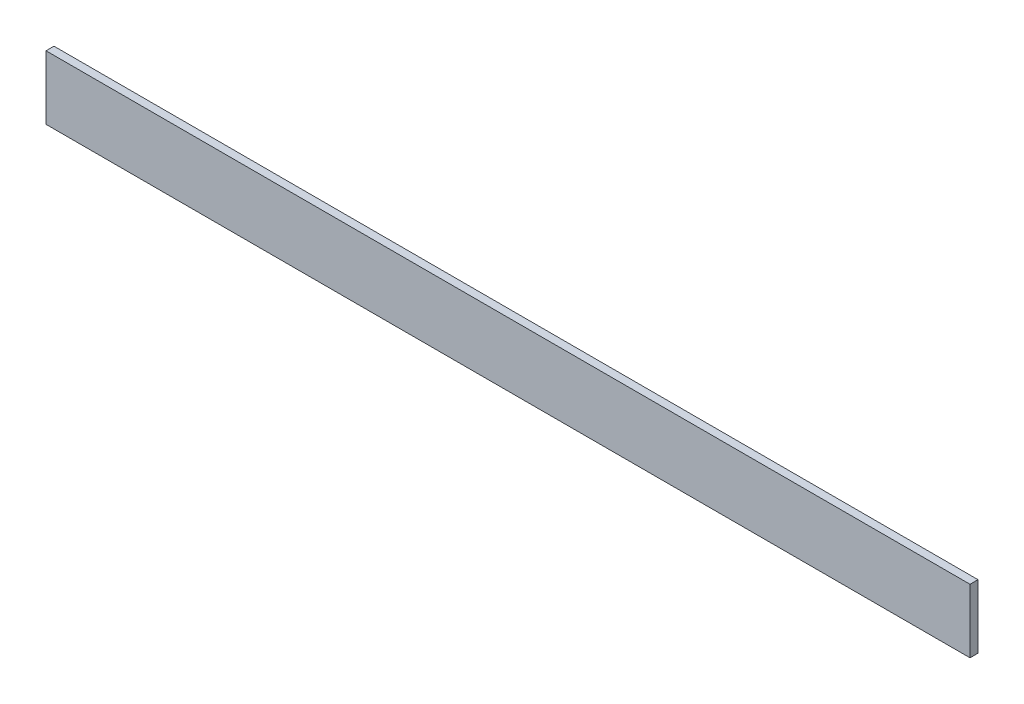
ISO-10303-21;
HEADER;
FILE_DESCRIPTION(('STEP AP214'),'2;1');
FILE_NAME('part.step','',(''),(''),'','','');
FILE_SCHEMA(('AUTOMOTIVE_DESIGN { 1 0 10303 214 1 1 1 1 }'));
ENDSEC;
DATA;
#1=APPLICATION_CONTEXT('core data for automotive mechanical design processes');
#2=APPLICATION_PROTOCOL_DEFINITION('international standard','automotive_design',2000,#1);
#3=PRODUCT_CONTEXT('',#1,'mechanical');
#4=PRODUCT('Part','Part','',(#3));
#5=PRODUCT_RELATED_PRODUCT_CATEGORY('part','',(#4));
#6=PRODUCT_DEFINITION_FORMATION('','',#4);
#7=PRODUCT_DEFINITION_CONTEXT('part definition',#1,'design');
#8=PRODUCT_DEFINITION('design','',#6,#7);
#9=PRODUCT_DEFINITION_SHAPE('','',#8);
#10=(LENGTH_UNIT() NAMED_UNIT(*) SI_UNIT(.MILLI.,.METRE.));
#11=(NAMED_UNIT(*) PLANE_ANGLE_UNIT() SI_UNIT($,.RADIAN.));
#12=(NAMED_UNIT(*) SI_UNIT($,.STERADIAN.) SOLID_ANGLE_UNIT());
#13=UNCERTAINTY_MEASURE_WITH_UNIT(LENGTH_MEASURE(1.E-05),#10,'distance_accuracy_value','');
#14=(GEOMETRIC_REPRESENTATION_CONTEXT(3) GLOBAL_UNCERTAINTY_ASSIGNED_CONTEXT((#13)) GLOBAL_UNIT_ASSIGNED_CONTEXT((#10,
#11,#12)) REPRESENTATION_CONTEXT('',''));
#15=CARTESIAN_POINT('',(0.,0.,0.));
#16=DIRECTION('',(0.,0.,1.));
#17=DIRECTION('',(1.,0.,0.));
#18=AXIS2_PLACEMENT_3D('',#15,#16,#17);
#19=CARTESIAN_POINT('',(290.,-20.,5.));
#20=DIRECTION('',(-1.,0.,0.));
#21=DIRECTION('',(0.,0.,1.));
#22=AXIS2_PLACEMENT_3D('',#19,#20,#21);
#23=PLANE('',#22);
#24=DIRECTION('',(0.,1.,0.));
#25=VECTOR('',#24,1.);
#26=CARTESIAN_POINT('',(290.,-20.,0.));
#27=LINE('',#26,#25);
#28=CARTESIAN_POINT('',(290.,-20.,0.));
#29=VERTEX_POINT('',#28);
#30=CARTESIAN_POINT('',(290.,20.,0.));
#31=VERTEX_POINT('',#30);
#32=EDGE_CURVE('E96',#29,#31,#27,.T.);
#33=ORIENTED_EDGE('',*,*,#32,.T.);
#34=DIRECTION('',(0.,0.,-1.));
#35=VECTOR('',#34,1.);
#36=CARTESIAN_POINT('',(290.,20.,5.));
#37=LINE('',#36,#35);
#38=CARTESIAN_POINT('',(290.,20.,5.));
#39=VERTEX_POINT('',#38);
#40=EDGE_CURVE('E11',#39,#31,#37,.T.);
#41=ORIENTED_EDGE('',*,*,#40,.F.);
#42=DIRECTION('',(0.,1.,0.));
#43=VECTOR('',#42,1.);
#44=CARTESIAN_POINT('',(290.,-20.,5.));
#45=LINE('',#44,#43);
#46=CARTESIAN_POINT('',(290.,-20.,5.));
#47=VERTEX_POINT('',#46);
#48=EDGE_CURVE('E84',#47,#39,#45,.T.);
#49=ORIENTED_EDGE('',*,*,#48,.F.);
#50=DIRECTION('',(0.,0.,-1.));
#51=VECTOR('',#50,1.);
#52=CARTESIAN_POINT('',(290.,-20.,5.));
#53=LINE('',#52,#51);
#54=EDGE_CURVE('E92',#47,#29,#53,.T.);
#55=ORIENTED_EDGE('',*,*,#54,.T.);
#56=EDGE_LOOP('',(#33,#41,#49,#55));
#57=FACE_BOUND('',#56,.T.);
#58=ADVANCED_FACE('F33',(#57),#23,.F.);
#59=CARTESIAN_POINT('',(-290.,20.,5.));
#60=DIRECTION('',(0.,-1.,0.));
#61=DIRECTION('',(0.,0.,-1.));
#62=AXIS2_PLACEMENT_3D('',#59,#60,#61);
#63=PLANE('',#62);
#64=DIRECTION('',(-1.,0.,0.));
#65=VECTOR('',#64,1.);
#66=CARTESIAN_POINT('',(-290.,20.,0.));
#67=LINE('',#66,#65);
#68=CARTESIAN_POINT('',(-290.,20.,0.));
#69=VERTEX_POINT('',#68);
#70=EDGE_CURVE('E88',#31,#69,#67,.T.);
#71=ORIENTED_EDGE('',*,*,#70,.T.);
#72=DIRECTION('',(0.,0.,-1.));
#73=VECTOR('',#72,1.);
#74=CARTESIAN_POINT('',(-290.,20.,5.));
#75=LINE('',#74,#73);
#76=CARTESIAN_POINT('',(-290.,20.,5.));
#77=VERTEX_POINT('',#76);
#78=EDGE_CURVE('E41',#77,#69,#75,.T.);
#79=ORIENTED_EDGE('',*,*,#78,.F.);
#80=DIRECTION('',(-1.,0.,0.));
#81=VECTOR('',#80,1.);
#82=CARTESIAN_POINT('',(-290.,20.,5.));
#83=LINE('',#82,#81);
#84=EDGE_CURVE('E79',#39,#77,#83,.T.);
#85=ORIENTED_EDGE('',*,*,#84,.F.);
#86=ORIENTED_EDGE('',*,*,#40,.T.);
#87=EDGE_LOOP('',(#71,#79,#85,#86));
#88=FACE_BOUND('',#87,.T.);
#89=ADVANCED_FACE('F87',(#88),#63,.F.);
#90=CARTESIAN_POINT('',(-290.,-20.,5.));
#91=DIRECTION('',(1.,0.,0.));
#92=DIRECTION('',(0.,0.,-1.));
#93=AXIS2_PLACEMENT_3D('',#90,#91,#92);
#94=PLANE('',#93);
#95=DIRECTION('',(0.,-1.,0.));
#96=VECTOR('',#95,1.);
#97=CARTESIAN_POINT('',(-290.,-20.,0.));
#98=LINE('',#97,#96);
#99=CARTESIAN_POINT('',(-290.,-20.,0.));
#100=VERTEX_POINT('',#99);
#101=EDGE_CURVE('E66',#69,#100,#98,.T.);
#102=ORIENTED_EDGE('',*,*,#101,.T.);
#103=DIRECTION('',(0.,0.,-1.));
#104=VECTOR('',#103,1.);
#105=CARTESIAN_POINT('',(-290.,-20.,5.));
#106=LINE('',#105,#104);
#107=CARTESIAN_POINT('',(-290.,-20.,5.));
#108=VERTEX_POINT('',#107);
#109=EDGE_CURVE('E89',#108,#100,#106,.T.);
#110=ORIENTED_EDGE('',*,*,#109,.F.);
#111=DIRECTION('',(0.,-1.,0.));
#112=VECTOR('',#111,1.);
#113=CARTESIAN_POINT('',(-290.,-20.,5.));
#114=LINE('',#113,#112);
#115=EDGE_CURVE('E82',#77,#108,#114,.T.);
#116=ORIENTED_EDGE('',*,*,#115,.F.);
#117=ORIENTED_EDGE('',*,*,#78,.T.);
#118=EDGE_LOOP('',(#102,#110,#116,#117));
#119=FACE_BOUND('',#118,.T.);
#120=ADVANCED_FACE('F90',(#119),#94,.F.);
#121=CARTESIAN_POINT('',(-290.,-20.,5.));
#122=DIRECTION('',(0.,1.,0.));
#123=DIRECTION('',(0.,0.,1.));
#124=AXIS2_PLACEMENT_3D('',#121,#122,#123);
#125=PLANE('',#124);
#126=DIRECTION('',(1.,0.,0.));
#127=VECTOR('',#126,1.);
#128=CARTESIAN_POINT('',(-290.,-20.,0.));
#129=LINE('',#128,#127);
#130=EDGE_CURVE('E72',#100,#29,#129,.T.);
#131=ORIENTED_EDGE('',*,*,#130,.T.);
#132=ORIENTED_EDGE('',*,*,#54,.F.);
#133=DIRECTION('',(1.,0.,0.));
#134=VECTOR('',#133,1.);
#135=CARTESIAN_POINT('',(-290.,-20.,5.));
#136=LINE('',#135,#134);
#137=EDGE_CURVE('E49',#108,#47,#136,.T.);
#138=ORIENTED_EDGE('',*,*,#137,.F.);
#139=ORIENTED_EDGE('',*,*,#109,.T.);
#140=EDGE_LOOP('',(#131,#132,#138,#139));
#141=FACE_BOUND('',#140,.T.);
#142=ADVANCED_FACE('F103',(#141),#125,.F.);
#143=CARTESIAN_POINT('',(0.,0.,5.));
#144=DIRECTION('',(0.,0.,-1.));
#145=DIRECTION('',(-1.,0.,0.));
#146=AXIS2_PLACEMENT_3D('',#143,#144,#145);
#147=PLANE('',#146);
#148=ORIENTED_EDGE('',*,*,#48,.T.);
#149=ORIENTED_EDGE('',*,*,#84,.T.);
#150=ORIENTED_EDGE('',*,*,#115,.T.);
#151=ORIENTED_EDGE('',*,*,#137,.T.);
#152=EDGE_LOOP('',(#148,#149,#150,#151));
#153=FACE_BOUND('',#152,.T.);
#154=ADVANCED_FACE('F80',(#153),#147,.F.);
#155=CARTESIAN_POINT('',(0.,0.,0.));
#156=DIRECTION('',(0.,0.,-1.));
#157=DIRECTION('',(-1.,0.,0.));
#158=AXIS2_PLACEMENT_3D('',#155,#156,#157);
#159=PLANE('',#158);
#160=ORIENTED_EDGE('',*,*,#32,.F.);
#161=ORIENTED_EDGE('',*,*,#130,.F.);
#162=ORIENTED_EDGE('',*,*,#101,.F.);
#163=ORIENTED_EDGE('',*,*,#70,.F.);
#164=EDGE_LOOP('',(#160,#161,#162,#163));
#165=FACE_BOUND('',#164,.T.);
#166=ADVANCED_FACE('F106',(#165),#159,.T.);
#167=CLOSED_SHELL('',(#58,#89,#120,#142,#154,#166));
#168=MANIFOLD_SOLID_BREP('B2',#167);
#169=ADVANCED_BREP_SHAPE_REPRESENTATION('',(#18,#168),#14);
#170=SHAPE_DEFINITION_REPRESENTATION(#9,#169);
ENDSEC;
END-ISO-10303-21;
